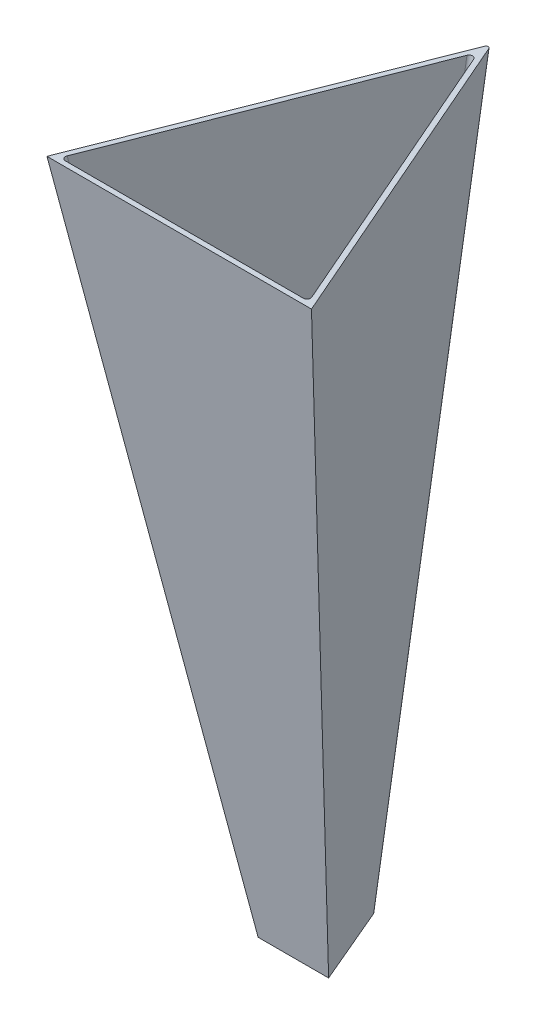
ISO-10303-21;
HEADER;
FILE_DESCRIPTION(('STEP AP214'),'2;1');
FILE_NAME('part.step','',(''),(''),'','','');
FILE_SCHEMA(('AUTOMOTIVE_DESIGN { 1 0 10303 214 1 1 1 1 }'));
ENDSEC;
DATA;
#1=APPLICATION_CONTEXT('core data for automotive mechanical design processes');
#2=APPLICATION_PROTOCOL_DEFINITION('international standard','automotive_design',2000,#1);
#3=PRODUCT_CONTEXT('',#1,'mechanical');
#4=PRODUCT('Part','Part','',(#3));
#5=PRODUCT_RELATED_PRODUCT_CATEGORY('part','',(#4));
#6=PRODUCT_DEFINITION_FORMATION('','',#4);
#7=PRODUCT_DEFINITION_CONTEXT('part definition',#1,'design');
#8=PRODUCT_DEFINITION('design','',#6,#7);
#9=PRODUCT_DEFINITION_SHAPE('','',#8);
#10=(LENGTH_UNIT() NAMED_UNIT(*) SI_UNIT(.MILLI.,.METRE.));
#11=(NAMED_UNIT(*) PLANE_ANGLE_UNIT() SI_UNIT($,.RADIAN.));
#12=(NAMED_UNIT(*) SI_UNIT($,.STERADIAN.) SOLID_ANGLE_UNIT());
#13=UNCERTAINTY_MEASURE_WITH_UNIT(LENGTH_MEASURE(1.E-05),#10,'distance_accuracy_value','');
#14=(GEOMETRIC_REPRESENTATION_CONTEXT(3) GLOBAL_UNCERTAINTY_ASSIGNED_CONTEXT((#13)) GLOBAL_UNIT_ASSIGNED_CONTEXT((#10,
#11,#12)) REPRESENTATION_CONTEXT('',''));
#15=CARTESIAN_POINT('',(0.,0.,0.));
#16=DIRECTION('',(0.,0.,1.));
#17=DIRECTION('',(1.,0.,0.));
#18=AXIS2_PLACEMENT_3D('',#15,#16,#17);
#19=CARTESIAN_POINT('',(0.,98.2055729673887,2.15598320176463));
#20=DIRECTION('',(0.,-0.999759102923365,-0.021948487917583));
#21=DIRECTION('',(0.,0.021948487917583,-0.999759102923365));
#22=AXIS2_PLACEMENT_3D('',#19,#20,#21);
#23=PLANE('',#22);
#24=DIRECTION('',(1.,0.,0.));
#25=VECTOR('',#24,1.);
#26=CARTESIAN_POINT('',(-12.634424951055,97.9206219249815,15.1355743063452));
#27=LINE('',#26,#25);
#28=CARTESIAN_POINT('',(-11.8861998080782,97.9206219249815,15.1355743063452));
#29=VERTEX_POINT('',#28);
#30=CARTESIAN_POINT('',(20.3862019228762,97.9206219249815,15.1355743063452));
#31=VERTEX_POINT('',#30);
#32=EDGE_CURVE('E288',#29,#31,#27,.T.);
#33=ORIENTED_EDGE('',*,*,#32,.F.);
#34=CARTESIAN_POINT('',(-11.8761267311856,97.9317096361329,14.6305262959443));
#35=DIRECTION('',(0.,-0.999759102923365,-0.021948487917583));
#36=DIRECTION('',(-0.699655824041886,-0.0156817565302998,0.71430792407504));
#37=AXIS2_PLACEMENT_3D('',#34,#35,#36);
#38=ELLIPSE('',#37,0.510077899504443,0.5);
#39=CARTESIAN_POINT('',(-12.340515051365,97.9358598736075,14.441481943088));
#40=VERTEX_POINT('',#39);
#41=EDGE_CURVE('E312',#29,#40,#38,.T.);
#42=ORIENTED_EDGE('',*,*,#41,.T.);
#43=DIRECTION('',(-0.389847754759341,-0.0202119087013318,0.920657486178084));
#44=VECTOR('',#43,1.);
#45=CARTESIAN_POINT('',(4.25,98.7960058445218,-24.7383817219428));
#46=LINE('',#45,#44);
#47=CARTESIAN_POINT('',(3.79081031359216,98.7721988585768,-23.6539675699923));
#48=VERTEX_POINT('',#47);
#49=EDGE_CURVE('E277',#48,#40,#46,.T.);
#50=ORIENTED_EDGE('',*,*,#49,.F.);
#51=CARTESIAN_POINT('',(4.25000106609931,98.7677792545113,-23.4526535016907));
#52=DIRECTION('',(0.,-0.999759102923365,-0.021948487917583));
#53=DIRECTION('',(6.03111288347783E-08,0.021948487917583,-0.999759102923363));
#54=AXIS2_PLACEMENT_3D('',#51,#52,#53);
#55=ELLIPSE('',#54,0.508881528574889,0.5);
#56=CARTESIAN_POINT('',(4.70919001976571,98.7721988412936,-23.6539667827403));
#57=VERTEX_POINT('',#56);
#58=EDGE_CURVE('E324',#48,#57,#55,.T.);
#59=ORIENTED_EDGE('',*,*,#58,.T.);
#60=DIRECTION('',(-0.389847754759341,0.0202119087013315,-0.920657486178084));
#61=VECTOR('',#60,1.);
#62=CARTESIAN_POINT('',(21.134424951055,97.9206219249815,15.1355743063452));
#63=LINE('',#62,#61);
#64=CARTESIAN_POINT('',(20.8405153630362,97.9358598574487,14.4414826791252));
#65=VERTEX_POINT('',#64);
#66=EDGE_CURVE('E270',#65,#57,#63,.T.);
#67=ORIENTED_EDGE('',*,*,#66,.F.);
#68=CARTESIAN_POINT('',(20.3761288443662,97.9317096361328,14.6305262959443));
#69=DIRECTION('',(0.,-0.999759102923365,-0.021948487917583));
#70=DIRECTION('',(0.69965588139157,-0.0156817552976769,0.714307867928787));
#71=AXIS2_PLACEMENT_3D('',#68,#69,#70);
#72=ELLIPSE('',#71,0.510077901073085,0.5);
#73=EDGE_CURVE('E319',#65,#31,#72,.T.);
#74=ORIENTED_EDGE('',*,*,#73,.T.);
#75=EDGE_LOOP('',(#33,#42,#50,#59,#67,#74));
#76=FACE_BOUND('',#75,.T.);
#77=DIRECTION('',(-0.389847754759341,0.0202119087013313,-0.920657486178084));
#78=VECTOR('',#77,1.);
#79=CARTESIAN_POINT('',(22.1909080359713,97.9052579834392,15.8354056783916));
#80=LINE('',#79,#78);
#81=CARTESIAN_POINT('',(22.1909080359713,97.9052579834392,15.8354056783916));
#82=VERTEX_POINT('',#81);
#83=CARTESIAN_POINT('',(4.52551431050938,98.821131751498,-25.882869618192));
#84=VERTEX_POINT('',#83);
#85=EDGE_CURVE('E159',#82,#84,#80,.T.);
#86=ORIENTED_EDGE('',*,*,#85,.T.);
#87=CARTESIAN_POINT('',(4.249998866712,98.818479914242,-25.7620812071592));
#88=DIRECTION('',(0.,-0.999759102923365,-0.021948487917583));
#89=DIRECTION('',(6.40724369991779E-08,-0.021948487917583,0.999759102923363));
#90=AXIS2_PLACEMENT_3D('',#87,#88,#89);
#91=ELLIPSE('',#90,0.305328275134823,0.3);
#92=CARTESIAN_POINT('',(3.97448437884599,98.8211316653957,-25.8828691871625));
#93=VERTEX_POINT('',#92);
#94=EDGE_CURVE('E12',#84,#93,#91,.F.);
#95=ORIENTED_EDGE('',*,*,#94,.T.);
#96=DIRECTION('',(-0.389847754759341,-0.0202119087013316,0.920657486178084));
#97=VECTOR('',#96,1.);
#98=CARTESIAN_POINT('',(4.25,98.8354159510435,-26.5335219106515));
#99=LINE('',#98,#97);
#100=CARTESIAN_POINT('',(-13.6909080359713,97.9052579834392,15.8354056783916));
#101=VERTEX_POINT('',#100);
#102=EDGE_CURVE('E52',#93,#101,#99,.T.);
#103=ORIENTED_EDGE('',*,*,#102,.T.);
#104=DIRECTION('',(1.,0.,0.));
#105=VECTOR('',#104,1.);
#106=CARTESIAN_POINT('',(-13.6909080359713,97.9052579834392,15.8354056783916));
#107=LINE('',#106,#105);
#108=EDGE_CURVE('E155',#101,#82,#107,.T.);
#109=ORIENTED_EDGE('',*,*,#108,.T.);
#110=EDGE_LOOP('',(#86,#95,#103,#109));
#111=FACE_BOUND('',#110,.T.);
#112=ADVANCED_FACE('F48',(#76,#111),#23,.F.);
#113=CARTESIAN_POINT('',(0.,5.,0.));
#114=DIRECTION('',(0.,-1.,0.));
#115=DIRECTION('',(0.,0.,-1.));
#116=AXIS2_PLACEMENT_3D('',#113,#114,#115);
#117=PLANE('',#116);
#118=DIRECTION('',(-0.391140640344852,0.,-0.920330918458474));
#119=VECTOR('',#118,1.);
#120=CARTESIAN_POINT('',(7.97095200828824,5.,-0.35));
#121=LINE('',#120,#119);
#122=CARTESIAN_POINT('',(7.67488379102564,5.,-1.04663109944141));
#123=VERTEX_POINT('',#122);
#124=CARTESIAN_POINT('',(4.70919070382039,5.,-8.02473248110081));
#125=VERTEX_POINT('',#124);
#126=EDGE_CURVE('E266',#123,#125,#121,.T.);
#127=ORIENTED_EDGE('',*,*,#126,.T.);
#128=CARTESIAN_POINT('',(4.24999999963005,5.,-7.82415505841352));
#129=DIRECTION('',(0.,-1.,0.));
#130=DIRECTION('',(6.82387541867847E-08,0.,-0.999999999999998));
#131=AXIS2_PLACEMENT_3D('',#128,#129,#130);
#132=ELLIPSE('',#131,0.506897346734136,0.5);
#133=CARTESIAN_POINT('',(3.79080929555556,5.,-8.02473247963247));
#134=VERTEX_POINT('',#133);
#135=EDGE_CURVE('E323',#125,#134,#132,.F.);
#136=ORIENTED_EDGE('',*,*,#135,.T.);
#137=DIRECTION('',(-0.391140640344852,0.,0.920330918458475));
#138=VECTOR('',#137,1.);
#139=CARTESIAN_POINT('',(4.25,5.,-9.10518119597232));
#140=LINE('',#139,#138);
#141=CARTESIAN_POINT('',(0.825116209823763,5.,-1.04663110144));
#142=VERTEX_POINT('',#141);
#143=EDGE_CURVE('E297',#134,#142,#140,.T.);
#144=ORIENTED_EDGE('',*,*,#143,.T.);
#145=CARTESIAN_POINT('',(1.28891482311118,5.,-0.856895819545588));
#146=DIRECTION('',(0.,-1.,0.));
#147=DIRECTION('',(-0.647669348025338,0.,0.761921528524056));
#148=AXIS2_PLACEMENT_3D('',#145,#146,#147);
#149=ELLIPSE('',#148,0.511820785564828,0.5);
#150=CARTESIAN_POINT('',(1.27727102102026,5.,-0.35));
#151=VERTEX_POINT('',#150);
#152=EDGE_CURVE('E315',#142,#151,#149,.F.);
#153=ORIENTED_EDGE('',*,*,#152,.T.);
#154=DIRECTION('',(1.,0.,0.));
#155=VECTOR('',#154,1.);
#156=CARTESIAN_POINT('',(0.529047991711764,5.,-0.35));
#157=LINE('',#156,#155);
#158=CARTESIAN_POINT('',(7.2227289801095,5.,-0.35));
#159=VERTEX_POINT('',#158);
#160=EDGE_CURVE('E271',#151,#159,#157,.T.);
#161=ORIENTED_EDGE('',*,*,#160,.T.);
#162=CARTESIAN_POINT('',(7.21108517614893,5.,-0.856895819545586));
#163=DIRECTION('',(0.,-1.,0.));
#164=DIRECTION('',(0.647669408397982,0.,0.761921477204448));
#165=AXIS2_PLACEMENT_3D('',#162,#163,#164);
#166=ELLIPSE('',#165,0.511820787138829,0.5);
#167=EDGE_CURVE('E321',#159,#123,#166,.F.);
#168=ORIENTED_EDGE('',*,*,#167,.T.);
#169=EDGE_LOOP('',(#127,#136,#144,#153,#161,#168));
#170=FACE_BOUND('',#169,.T.);
#171=DIRECTION('',(-0.391140640344852,0.,0.920330918458475));
#172=VECTOR('',#171,1.);
#173=CARTESIAN_POINT('',(4.25,5.,-10.8948188040277));
#174=LINE('',#173,#172);
#175=CARTESIAN_POINT('',(3.97448549786293,5.,-10.2465493872346));
#176=VERTEX_POINT('',#175);
#177=CARTESIAN_POINT('',(-0.529047991711763,5.,0.35));
#178=VERTEX_POINT('',#177);
#179=EDGE_CURVE('E128',#176,#178,#174,.T.);
#180=ORIENTED_EDGE('',*,*,#179,.F.);
#181=CARTESIAN_POINT('',(4.25000000023578,5.,-10.1262033442718));
#182=DIRECTION('',(0.,-1.,0.));
#183=DIRECTION('',(7.24950521081867E-08,0.,0.999999999999997));
#184=AXIS2_PLACEMENT_3D('',#181,#182,#183);
#185=ELLIPSE('',#184,0.304137845034174,0.3);
#186=CARTESIAN_POINT('',(4.52551450253479,5.,-10.2465493862988));
#187=VERTEX_POINT('',#186);
#188=EDGE_CURVE('E73',#176,#187,#185,.T.);
#189=ORIENTED_EDGE('',*,*,#188,.T.);
#190=DIRECTION('',(-0.391140640344852,0.,-0.920330918458475));
#191=VECTOR('',#190,1.);
#192=CARTESIAN_POINT('',(9.02904799171177,5.,0.35));
#193=LINE('',#192,#191);
#194=CARTESIAN_POINT('',(9.02904799171177,5.,0.35));
#195=VERTEX_POINT('',#194);
#196=EDGE_CURVE('E140',#195,#187,#193,.T.);
#197=ORIENTED_EDGE('',*,*,#196,.F.);
#198=DIRECTION('',(1.,0.,0.));
#199=VECTOR('',#198,1.);
#200=CARTESIAN_POINT('',(-0.529047991711763,5.,0.35));
#201=LINE('',#200,#199);
#202=EDGE_CURVE('E139',#178,#195,#201,.T.);
#203=ORIENTED_EDGE('',*,*,#202,.F.);
#204=EDGE_LOOP('',(#180,#189,#197,#203));
#205=FACE_BOUND('',#204,.T.);
#206=ADVANCED_FACE('F146',(#170,#205),#117,.T.);
#207=CARTESIAN_POINT('',(4.25,5.,-10.8948188040277));
#208=DIRECTION('',(-0.918381673790215,-0.0650498186691753,-0.390312211360841));
#209=DIRECTION('',(-0.391140640344852,0.,0.920330918458475));
#210=AXIS2_PLACEMENT_3D('',#207,#208,#209);
#211=PLANE('',#210);
#212=ORIENTED_EDGE('',*,*,#102,.F.);
#213=DIRECTION('',(1.19177160518984E-08,-0.986394836743486,0.164393509743518));
#214=VECTOR('',#213,1.);
#215=CARTESIAN_POINT('',(3.97448549659285,5.10512136172056,-10.2640690142222));
#216=LINE('',#215,#214);
#217=EDGE_CURVE('E137',#93,#176,#216,.T.);
#218=ORIENTED_EDGE('',*,*,#217,.T.);
#219=ORIENTED_EDGE('',*,*,#179,.T.);
#220=DIRECTION('',(-0.138397079048773,0.976899639560331,0.162829182696665));
#221=VECTOR('',#220,1.);
#222=CARTESIAN_POINT('',(-7.10997801384154,51.4526289917196,8.09270283919578));
#223=LINE('',#222,#221);
#224=EDGE_CURVE('E134',#178,#101,#223,.T.);
#225=ORIENTED_EDGE('',*,*,#224,.T.);
#226=EDGE_LOOP('',(#212,#218,#219,#225));
#227=FACE_BOUND('',#226,.T.);
#228=ADVANCED_FACE('F132',(#227),#211,.T.);
#229=CARTESIAN_POINT('',(0.,0.078394543838926,-0.47033093424298));
#230=DIRECTION('',(0.,0.164411342396426,-0.986391864570773));
#231=DIRECTION('',(0.,0.986391864570773,0.164411342396426));
#232=AXIS2_PLACEMENT_3D('',#229,#230,#231);
#233=PLANE('',#232);
#234=DIRECTION('',(0.138397079048773,0.97689963956033,0.162829182696665));
#235=VECTOR('',#234,1.);
#236=CARTESIAN_POINT('',(9.02904799171177,5.,0.35));
#237=LINE('',#236,#235);
#238=EDGE_CURVE('E157',#195,#82,#237,.T.);
#239=ORIENTED_EDGE('',*,*,#238,.T.);
#240=ORIENTED_EDGE('',*,*,#108,.F.);
#241=ORIENTED_EDGE('',*,*,#224,.F.);
#242=ORIENTED_EDGE('',*,*,#202,.T.);
#243=EDGE_LOOP('',(#239,#240,#241,#242));
#244=FACE_BOUND('',#243,.T.);
#245=ADVANCED_FACE('F154',(#244),#233,.F.);
#246=CARTESIAN_POINT('',(9.02904799171177,5.,0.35));
#247=DIRECTION('',(0.918381675115974,-0.0650497965711309,-0.390312211924289));
#248=DIRECTION('',(-0.391140640344852,0.,-0.920330918458474));
#249=AXIS2_PLACEMENT_3D('',#246,#247,#248);
#250=PLANE('',#249);
#251=ORIENTED_EDGE('',*,*,#196,.T.);
#252=DIRECTION('',(1.19177160373909E-08,-0.986394836743486,0.164393509743518));
#253=VECTOR('',#252,1.);
#254=CARTESIAN_POINT('',(4.5255145232955,3.28169625033649,-9.96017523500534));
#255=LINE('',#254,#253);
#256=EDGE_CURVE('E58',#187,#84,#255,.F.);
#257=ORIENTED_EDGE('',*,*,#256,.T.);
#258=ORIENTED_EDGE('',*,*,#85,.F.);
#259=ORIENTED_EDGE('',*,*,#238,.F.);
#260=EDGE_LOOP('',(#251,#257,#258,#259));
#261=FACE_BOUND('',#260,.T.);
#262=ADVANCED_FACE('F177',(#261),#250,.T.);
#263=CARTESIAN_POINT('',(4.25,5.,-9.10518119597232));
#264=DIRECTION('',(-0.918381408888869,-0.0650542339512812,-0.390312098777769));
#265=DIRECTION('',(-0.391140640344852,0.,0.920330918458475));
#266=AXIS2_PLACEMENT_3D('',#263,#264,#265);
#267=PLANE('',#266);
#268=ORIENTED_EDGE('',*,*,#49,.T.);
#269=DIRECTION('',(-0.138391811056564,0.976904444097981,0.162804833263939));
#270=VECTOR('',#269,1.);
#271=CARTESIAN_POINT('',(1.07227661844868,3.25530065870685,-1.33739186834101));
#272=LINE('',#271,#270);
#273=EDGE_CURVE('E272',#40,#142,#272,.F.);
#274=ORIENTED_EDGE('',*,*,#273,.T.);
#275=ORIENTED_EDGE('',*,*,#143,.F.);
#276=DIRECTION('',(-1.12187559161756E-08,-0.986393010777084,0.164404465541904));
#277=VECTOR('',#276,1.);
#278=CARTESIAN_POINT('',(3.79081036433865,98.9712190187281,-23.68713871153));
#279=LINE('',#278,#277);
#280=EDGE_CURVE('E296',#134,#48,#279,.F.);
#281=ORIENTED_EDGE('',*,*,#280,.T.);
#282=EDGE_LOOP('',(#268,#274,#275,#281));
#283=FACE_BOUND('',#282,.T.);
#284=ADVANCED_FACE('F186',(#283),#267,.F.);
#285=CARTESIAN_POINT('',(0.,0.191867437927008,-1.1512935398221));
#286=DIRECTION('',(0.,0.164386634179781,-0.986395982606906));
#287=DIRECTION('',(0.,0.986395982606906,0.164386634179781));
#288=AXIS2_PLACEMENT_3D('',#285,#286,#287);
#289=PLANE('',#288);
#290=ORIENTED_EDGE('',*,*,#160,.F.);
#291=DIRECTION('',(-0.138391811056564,0.976904444097981,0.162804833263939));
#292=VECTOR('',#291,1.);
#293=CARTESIAN_POINT('',(1.92090042845203,0.456635593740074,-1.10716892177868));
#294=LINE('',#293,#292);
#295=EDGE_CURVE('E293',#151,#29,#294,.T.);
#296=ORIENTED_EDGE('',*,*,#295,.T.);
#297=ORIENTED_EDGE('',*,*,#32,.T.);
#298=DIRECTION('',(0.138391832852643,0.976904441093709,0.162804832763266));
#299=VECTOR('',#298,1.);
#300=CARTESIAN_POINT('',(6.41630493229208,-0.692526917801871,-1.29868121575488));
#301=LINE('',#300,#299);
#302=EDGE_CURVE('E291',#31,#159,#301,.F.);
#303=ORIENTED_EDGE('',*,*,#302,.T.);
#304=EDGE_LOOP('',(#290,#296,#297,#303));
#305=FACE_BOUND('',#304,.T.);
#306=ADVANCED_FACE('F366',(#305),#289,.T.);
#307=CARTESIAN_POINT('',(7.97095200828824,5.,-0.35));
#308=DIRECTION('',(0.918381407640777,-0.0650542547533216,-0.390312098247331));
#309=DIRECTION('',(-0.391140640344852,0.,-0.920330918458474));
#310=AXIS2_PLACEMENT_3D('',#307,#308,#309);
#311=PLANE('',#310);
#312=ORIENTED_EDGE('',*,*,#126,.F.);
#313=DIRECTION('',(0.138391832852643,0.976904441093709,0.162804832763266));
#314=VECTOR('',#313,1.);
#315=CARTESIAN_POINT('',(7.69624987538378,5.15082264804219,-1.0214959327265));
#316=LINE('',#315,#314);
#317=EDGE_CURVE('E307',#123,#65,#316,.T.);
#318=ORIENTED_EDGE('',*,*,#317,.T.);
#319=ORIENTED_EDGE('',*,*,#66,.T.);
#320=DIRECTION('',(-1.12187559300534E-08,-0.986393010777084,0.164404465541904));
#321=VECTOR('',#320,1.);
#322=CARTESIAN_POINT('',(4.70919070581318,5.17521357086083,-8.05393574304442));
#323=LINE('',#322,#321);
#324=EDGE_CURVE('E278',#57,#125,#323,.T.);
#325=ORIENTED_EDGE('',*,*,#324,.T.);
#326=EDGE_LOOP('',(#312,#318,#319,#325));
#327=FACE_BOUND('',#326,.T.);
#328=ADVANCED_FACE('F220',(#327),#311,.F.);
#329=CARTESIAN_POINT('',(1.92090042845203,0.538828910829964,-1.60036691308213));
#330=DIRECTION('',(-0.138391811056564,0.976904444097981,0.162804833263939));
#331=DIRECTION('',(0.,-0.164386634179781,0.986395982606906));
#332=AXIS2_PLACEMENT_3D('',#329,#330,#331);
#333=CYLINDRICAL_SURFACE('',#332,0.5);
#334=ORIENTED_EDGE('',*,*,#152,.F.);
#335=ORIENTED_EDGE('',*,*,#273,.F.);
#336=ORIENTED_EDGE('',*,*,#41,.F.);
#337=ORIENTED_EDGE('',*,*,#295,.F.);
#338=EDGE_LOOP('',(#334,#335,#336,#337));
#339=FACE_BOUND('',#338,.T.);
#340=ADVANCED_FACE('F373',(#339),#333,.F.);
#341=CARTESIAN_POINT('',(7.23705917156339,5.18334977541885,-0.826339883602835));
#342=DIRECTION('',(0.138391832852643,0.976904441093709,0.162804832763266));
#343=DIRECTION('',(0.,-0.164386634179781,0.986395982606906));
#344=AXIS2_PLACEMENT_3D('',#341,#342,#343);
#345=CYLINDRICAL_SURFACE('',#344,0.5);
#346=ORIENTED_EDGE('',*,*,#167,.F.);
#347=ORIENTED_EDGE('',*,*,#302,.F.);
#348=ORIENTED_EDGE('',*,*,#73,.F.);
#349=ORIENTED_EDGE('',*,*,#317,.F.);
#350=EDGE_LOOP('',(#346,#347,#348,#349));
#351=FACE_BOUND('',#350,.T.);
#352=ADVANCED_FACE('F371',(#351),#345,.F.);
#353=CARTESIAN_POINT('',(4.24999998584462,3.78793563043068,-7.62213741158892));
#354=DIRECTION('',(1.12187559113237E-08,0.986393010777084,-0.164404465541904));
#355=DIRECTION('',(0.,0.164404465541904,0.986393010777084));
#356=AXIS2_PLACEMENT_3D('',#353,#354,#355);
#357=CYLINDRICAL_SURFACE('',#356,0.5);
#358=ORIENTED_EDGE('',*,*,#58,.F.);
#359=ORIENTED_EDGE('',*,*,#280,.F.);
#360=ORIENTED_EDGE('',*,*,#135,.F.);
#361=ORIENTED_EDGE('',*,*,#324,.F.);
#362=EDGE_LOOP('',(#358,#359,#360,#361));
#363=FACE_BOUND('',#362,.T.);
#364=ADVANCED_FACE('F387',(#363),#357,.F.);
#365=CARTESIAN_POINT('',(4.24999999872991,5.12463630732131,-10.146975350814));
#366=DIRECTION('',(1.19177160551041E-08,-0.986394836743486,0.164393509743518));
#367=DIRECTION('',(0.,-0.164393509743518,-0.986394836743486));
#368=AXIS2_PLACEMENT_3D('',#365,#366,#367);
#369=CYLINDRICAL_SURFACE('',#368,0.3);
#370=ORIENTED_EDGE('',*,*,#94,.F.);
#371=ORIENTED_EDGE('',*,*,#256,.F.);
#372=ORIENTED_EDGE('',*,*,#188,.F.);
#373=ORIENTED_EDGE('',*,*,#217,.F.);
#374=EDGE_LOOP('',(#370,#371,#372,#373));
#375=FACE_BOUND('',#374,.T.);
#376=ADVANCED_FACE('F50',(#375),#369,.T.);
#377=CLOSED_SHELL('',(#112,#206,#228,#245,#262,#284,#306,#328,#340,#352,#364,#376));
#378=MANIFOLD_SOLID_BREP('B2',#377);
#379=ADVANCED_BREP_SHAPE_REPRESENTATION('',(#18,#378),#14);
#380=SHAPE_DEFINITION_REPRESENTATION(#9,#379);
ENDSEC;
END-ISO-10303-21;
